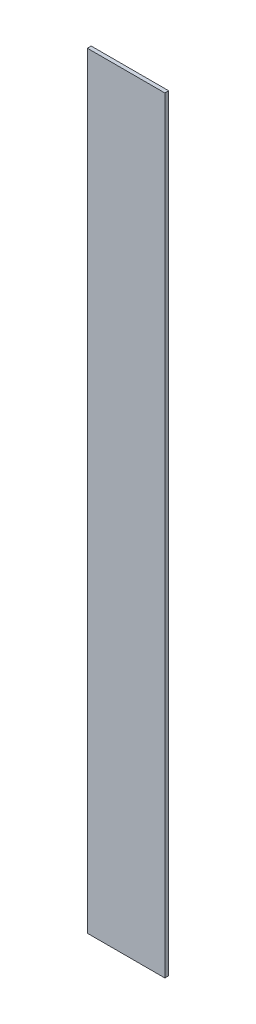
ISO-10303-21;
HEADER;
FILE_DESCRIPTION(('STEP AP214'),'2;1');
FILE_NAME('part.step','',(''),(''),'','','');
FILE_SCHEMA(('AUTOMOTIVE_DESIGN { 1 0 10303 214 1 1 1 1 }'));
ENDSEC;
DATA;
#1=APPLICATION_CONTEXT('core data for automotive mechanical design processes');
#2=APPLICATION_PROTOCOL_DEFINITION('international standard','automotive_design',2000,#1);
#3=PRODUCT_CONTEXT('',#1,'mechanical');
#4=PRODUCT('Part','Part','',(#3));
#5=PRODUCT_RELATED_PRODUCT_CATEGORY('part','',(#4));
#6=PRODUCT_DEFINITION_FORMATION('','',#4);
#7=PRODUCT_DEFINITION_CONTEXT('part definition',#1,'design');
#8=PRODUCT_DEFINITION('design','',#6,#7);
#9=PRODUCT_DEFINITION_SHAPE('','',#8);
#10=(LENGTH_UNIT() NAMED_UNIT(*) SI_UNIT(.MILLI.,.METRE.));
#11=(NAMED_UNIT(*) PLANE_ANGLE_UNIT() SI_UNIT($,.RADIAN.));
#12=(NAMED_UNIT(*) SI_UNIT($,.STERADIAN.) SOLID_ANGLE_UNIT());
#13=UNCERTAINTY_MEASURE_WITH_UNIT(LENGTH_MEASURE(1.E-05),#10,'distance_accuracy_value','');
#14=(GEOMETRIC_REPRESENTATION_CONTEXT(3) GLOBAL_UNCERTAINTY_ASSIGNED_CONTEXT((#13)) GLOBAL_UNIT_ASSIGNED_CONTEXT((#10,
#11,#12)) REPRESENTATION_CONTEXT('',''));
#15=CARTESIAN_POINT('',(0.,0.,0.));
#16=DIRECTION('',(0.,0.,1.));
#17=DIRECTION('',(1.,0.,0.));
#18=AXIS2_PLACEMENT_3D('',#15,#16,#17);
#19=CARTESIAN_POINT('',(0.,600.,0.));
#20=DIRECTION('',(1.,0.,0.));
#21=DIRECTION('',(0.,0.,-1.));
#22=AXIS2_PLACEMENT_3D('',#19,#20,#21);
#23=PLANE('',#22);
#24=DIRECTION('',(0.,0.,1.));
#25=VECTOR('',#24,1.);
#26=CARTESIAN_POINT('',(0.,0.,0.));
#27=LINE('',#26,#25);
#28=CARTESIAN_POINT('',(0.,0.,-3.));
#29=VERTEX_POINT('',#28);
#30=CARTESIAN_POINT('',(0.,0.,0.));
#31=VERTEX_POINT('',#30);
#32=EDGE_CURVE('E96',#29,#31,#27,.T.);
#33=ORIENTED_EDGE('',*,*,#32,.T.);
#34=DIRECTION('',(0.,-1.,0.));
#35=VECTOR('',#34,1.);
#36=CARTESIAN_POINT('',(0.,600.,0.));
#37=LINE('',#36,#35);
#38=CARTESIAN_POINT('',(0.,600.,0.));
#39=VERTEX_POINT('',#38);
#40=EDGE_CURVE('E11',#39,#31,#37,.T.);
#41=ORIENTED_EDGE('',*,*,#40,.F.);
#42=DIRECTION('',(0.,0.,1.));
#43=VECTOR('',#42,1.);
#44=CARTESIAN_POINT('',(0.,600.,0.));
#45=LINE('',#44,#43);
#46=CARTESIAN_POINT('',(0.,600.,-3.));
#47=VERTEX_POINT('',#46);
#48=EDGE_CURVE('E84',#47,#39,#45,.T.);
#49=ORIENTED_EDGE('',*,*,#48,.F.);
#50=DIRECTION('',(0.,-1.,0.));
#51=VECTOR('',#50,1.);
#52=CARTESIAN_POINT('',(0.,600.,-3.));
#53=LINE('',#52,#51);
#54=EDGE_CURVE('E92',#47,#29,#53,.T.);
#55=ORIENTED_EDGE('',*,*,#54,.T.);
#56=EDGE_LOOP('',(#33,#41,#49,#55));
#57=FACE_BOUND('',#56,.T.);
#58=ADVANCED_FACE('F33',(#57),#23,.F.);
#59=CARTESIAN_POINT('',(0.,600.,0.));
#60=DIRECTION('',(0.,0.,-1.));
#61=DIRECTION('',(-1.,0.,0.));
#62=AXIS2_PLACEMENT_3D('',#59,#60,#61);
#63=PLANE('',#62);
#64=DIRECTION('',(1.,0.,0.));
#65=VECTOR('',#64,1.);
#66=CARTESIAN_POINT('',(0.,0.,0.));
#67=LINE('',#66,#65);
#68=CARTESIAN_POINT('',(60.6585365853659,0.,0.));
#69=VERTEX_POINT('',#68);
#70=EDGE_CURVE('E88',#31,#69,#67,.T.);
#71=ORIENTED_EDGE('',*,*,#70,.T.);
#72=DIRECTION('',(0.,-1.,0.));
#73=VECTOR('',#72,1.);
#74=CARTESIAN_POINT('',(60.6585365853659,600.,0.));
#75=LINE('',#74,#73);
#76=CARTESIAN_POINT('',(60.6585365853659,600.,0.));
#77=VERTEX_POINT('',#76);
#78=EDGE_CURVE('E41',#77,#69,#75,.T.);
#79=ORIENTED_EDGE('',*,*,#78,.F.);
#80=DIRECTION('',(1.,0.,0.));
#81=VECTOR('',#80,1.);
#82=CARTESIAN_POINT('',(0.,600.,0.));
#83=LINE('',#82,#81);
#84=EDGE_CURVE('E79',#39,#77,#83,.T.);
#85=ORIENTED_EDGE('',*,*,#84,.F.);
#86=ORIENTED_EDGE('',*,*,#40,.T.);
#87=EDGE_LOOP('',(#71,#79,#85,#86));
#88=FACE_BOUND('',#87,.T.);
#89=ADVANCED_FACE('F87',(#88),#63,.F.);
#90=CARTESIAN_POINT('',(60.6585365853659,600.,0.));
#91=DIRECTION('',(-1.,0.,0.));
#92=DIRECTION('',(0.,0.,1.));
#93=AXIS2_PLACEMENT_3D('',#90,#91,#92);
#94=PLANE('',#93);
#95=DIRECTION('',(0.,0.,-1.));
#96=VECTOR('',#95,1.);
#97=CARTESIAN_POINT('',(60.6585365853659,0.,0.));
#98=LINE('',#97,#96);
#99=CARTESIAN_POINT('',(60.6585365853659,0.,-3.));
#100=VERTEX_POINT('',#99);
#101=EDGE_CURVE('E66',#69,#100,#98,.T.);
#102=ORIENTED_EDGE('',*,*,#101,.T.);
#103=DIRECTION('',(0.,-1.,0.));
#104=VECTOR('',#103,1.);
#105=CARTESIAN_POINT('',(60.6585365853659,600.,-3.));
#106=LINE('',#105,#104);
#107=CARTESIAN_POINT('',(60.6585365853659,600.,-3.));
#108=VERTEX_POINT('',#107);
#109=EDGE_CURVE('E89',#108,#100,#106,.T.);
#110=ORIENTED_EDGE('',*,*,#109,.F.);
#111=DIRECTION('',(0.,0.,-1.));
#112=VECTOR('',#111,1.);
#113=CARTESIAN_POINT('',(60.6585365853659,600.,0.));
#114=LINE('',#113,#112);
#115=EDGE_CURVE('E82',#77,#108,#114,.T.);
#116=ORIENTED_EDGE('',*,*,#115,.F.);
#117=ORIENTED_EDGE('',*,*,#78,.T.);
#118=EDGE_LOOP('',(#102,#110,#116,#117));
#119=FACE_BOUND('',#118,.T.);
#120=ADVANCED_FACE('F90',(#119),#94,.F.);
#121=CARTESIAN_POINT('',(0.,600.,-3.));
#122=DIRECTION('',(0.,0.,1.));
#123=DIRECTION('',(1.,0.,0.));
#124=AXIS2_PLACEMENT_3D('',#121,#122,#123);
#125=PLANE('',#124);
#126=DIRECTION('',(-1.,0.,0.));
#127=VECTOR('',#126,1.);
#128=CARTESIAN_POINT('',(0.,0.,-3.));
#129=LINE('',#128,#127);
#130=EDGE_CURVE('E72',#100,#29,#129,.T.);
#131=ORIENTED_EDGE('',*,*,#130,.T.);
#132=ORIENTED_EDGE('',*,*,#54,.F.);
#133=DIRECTION('',(-1.,0.,0.));
#134=VECTOR('',#133,1.);
#135=CARTESIAN_POINT('',(0.,600.,-3.));
#136=LINE('',#135,#134);
#137=EDGE_CURVE('E49',#108,#47,#136,.T.);
#138=ORIENTED_EDGE('',*,*,#137,.F.);
#139=ORIENTED_EDGE('',*,*,#109,.T.);
#140=EDGE_LOOP('',(#131,#132,#138,#139));
#141=FACE_BOUND('',#140,.T.);
#142=ADVANCED_FACE('F103',(#141),#125,.F.);
#143=CARTESIAN_POINT('',(0.,600.,0.));
#144=DIRECTION('',(0.,-1.,0.));
#145=DIRECTION('',(0.,0.,-1.));
#146=AXIS2_PLACEMENT_3D('',#143,#144,#145);
#147=PLANE('',#146);
#148=ORIENTED_EDGE('',*,*,#48,.T.);
#149=ORIENTED_EDGE('',*,*,#84,.T.);
#150=ORIENTED_EDGE('',*,*,#115,.T.);
#151=ORIENTED_EDGE('',*,*,#137,.T.);
#152=EDGE_LOOP('',(#148,#149,#150,#151));
#153=FACE_BOUND('',#152,.T.);
#154=ADVANCED_FACE('F80',(#153),#147,.F.);
#155=CARTESIAN_POINT('',(0.,0.,0.));
#156=DIRECTION('',(0.,-1.,0.));
#157=DIRECTION('',(0.,0.,-1.));
#158=AXIS2_PLACEMENT_3D('',#155,#156,#157);
#159=PLANE('',#158);
#160=ORIENTED_EDGE('',*,*,#32,.F.);
#161=ORIENTED_EDGE('',*,*,#130,.F.);
#162=ORIENTED_EDGE('',*,*,#101,.F.);
#163=ORIENTED_EDGE('',*,*,#70,.F.);
#164=EDGE_LOOP('',(#160,#161,#162,#163));
#165=FACE_BOUND('',#164,.T.);
#166=ADVANCED_FACE('F106',(#165),#159,.T.);
#167=CLOSED_SHELL('',(#58,#89,#120,#142,#154,#166));
#168=MANIFOLD_SOLID_BREP('B2',#167);
#169=ADVANCED_BREP_SHAPE_REPRESENTATION('',(#18,#168),#14);
#170=SHAPE_DEFINITION_REPRESENTATION(#9,#169);
ENDSEC;
END-ISO-10303-21;
